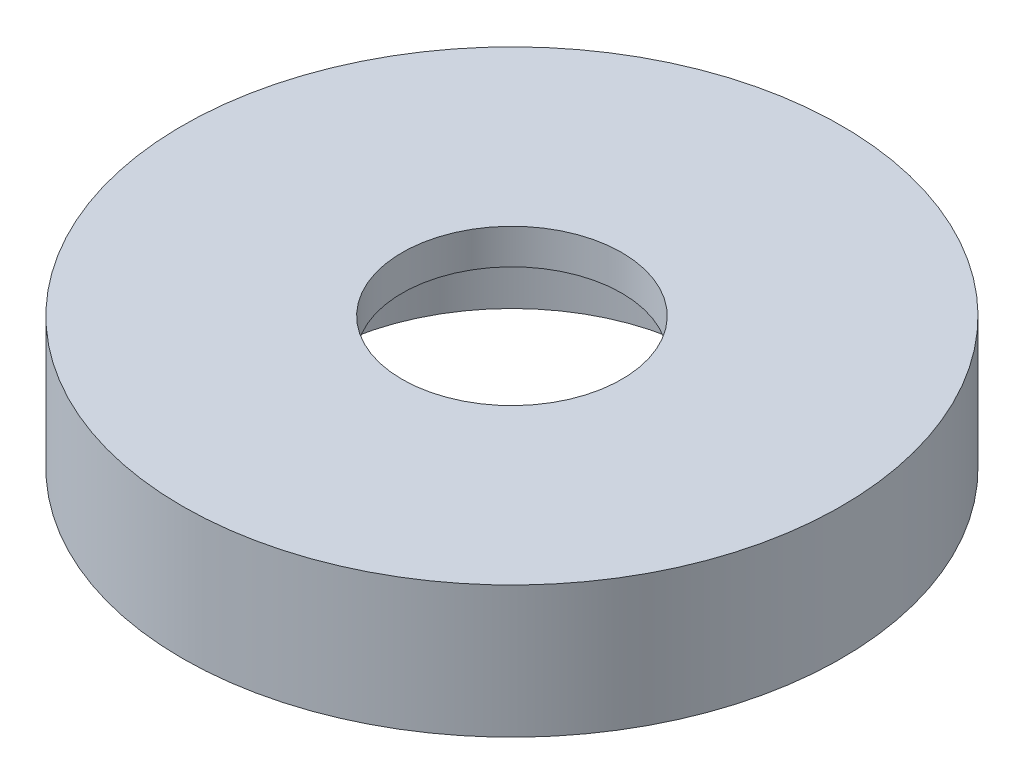
ISO-10303-21;
HEADER;
FILE_DESCRIPTION(('STEP AP214'),'2;1');
FILE_NAME('part.step','',(''),(''),'','','');
FILE_SCHEMA(('AUTOMOTIVE_DESIGN { 1 0 10303 214 1 1 1 1 }'));
ENDSEC;
DATA;
#1=APPLICATION_CONTEXT('core data for automotive mechanical design processes');
#2=APPLICATION_PROTOCOL_DEFINITION('international standard','automotive_design',2000,#1);
#3=PRODUCT_CONTEXT('',#1,'mechanical');
#4=PRODUCT('Part','Part','',(#3));
#5=PRODUCT_RELATED_PRODUCT_CATEGORY('part','',(#4));
#6=PRODUCT_DEFINITION_FORMATION('','',#4);
#7=PRODUCT_DEFINITION_CONTEXT('part definition',#1,'design');
#8=PRODUCT_DEFINITION('design','',#6,#7);
#9=PRODUCT_DEFINITION_SHAPE('','',#8);
#10=(LENGTH_UNIT() NAMED_UNIT(*) SI_UNIT(.MILLI.,.METRE.));
#11=(NAMED_UNIT(*) PLANE_ANGLE_UNIT() SI_UNIT($,.RADIAN.));
#12=(NAMED_UNIT(*) SI_UNIT($,.STERADIAN.) SOLID_ANGLE_UNIT());
#13=UNCERTAINTY_MEASURE_WITH_UNIT(LENGTH_MEASURE(1.E-05),#10,'distance_accuracy_value','');
#14=(GEOMETRIC_REPRESENTATION_CONTEXT(3) GLOBAL_UNCERTAINTY_ASSIGNED_CONTEXT((#13)) GLOBAL_UNIT_ASSIGNED_CONTEXT((#10,
#11,#12)) REPRESENTATION_CONTEXT('',''));
#15=CARTESIAN_POINT('',(0.,0.,0.));
#16=DIRECTION('',(0.,0.,1.));
#17=DIRECTION('',(1.,0.,0.));
#18=AXIS2_PLACEMENT_3D('',#15,#16,#17);
#19=CARTESIAN_POINT('',(0.,19.05,0.));
#20=DIRECTION('',(0.,-1.,0.));
#21=DIRECTION('',(0.,0.,-1.));
#22=AXIS2_PLACEMENT_3D('',#19,#20,#21);
#23=CYLINDRICAL_SURFACE('',#22,95.25);
#24=CARTESIAN_POINT('',(0.,19.05,0.));
#25=DIRECTION('',(0.,1.,0.));
#26=DIRECTION('',(0.,0.,1.));
#27=AXIS2_PLACEMENT_3D('',#24,#25,#26);
#28=CIRCLE('',#27,95.25);
#29=CARTESIAN_POINT('',(0.,19.05,95.25));
#30=VERTEX_POINT('',#29);
#31=EDGE_CURVE('E10',#30,#30,#28,.T.);
#32=ORIENTED_EDGE('',*,*,#31,.F.);
#33=EDGE_LOOP('',(#32));
#34=FACE_BOUND('',#33,.T.);
#35=CARTESIAN_POINT('',(0.,-19.05,0.));
#36=DIRECTION('',(0.,1.,0.));
#37=DIRECTION('',(0.,0.,1.));
#38=AXIS2_PLACEMENT_3D('',#35,#36,#37);
#39=CIRCLE('',#38,95.25);
#40=CARTESIAN_POINT('',(0.,-19.05,95.25));
#41=VERTEX_POINT('',#40);
#42=EDGE_CURVE('E39',#41,#41,#39,.T.);
#43=ORIENTED_EDGE('',*,*,#42,.T.);
#44=EDGE_LOOP('',(#43));
#45=FACE_BOUND('',#44,.T.);
#46=ADVANCED_FACE('F36',(#34,#45),#23,.T.);
#47=CARTESIAN_POINT('',(0.,19.05,0.));
#48=DIRECTION('',(0.,1.,0.));
#49=DIRECTION('',(0.,0.,1.));
#50=AXIS2_PLACEMENT_3D('',#47,#48,#49);
#51=PLANE('',#50);
#52=CARTESIAN_POINT('',(0.,19.05,0.));
#53=DIRECTION('',(0.,1.,0.));
#54=DIRECTION('',(0.,0.,1.));
#55=AXIS2_PLACEMENT_3D('',#52,#53,#54);
#56=CIRCLE('',#55,31.75);
#57=CARTESIAN_POINT('',(0.,19.05,31.75));
#58=VERTEX_POINT('',#57);
#59=EDGE_CURVE('E46',#58,#58,#56,.T.);
#60=ORIENTED_EDGE('',*,*,#59,.F.);
#61=EDGE_LOOP('',(#60));
#62=FACE_BOUND('',#61,.T.);
#63=ORIENTED_EDGE('',*,*,#31,.T.);
#64=EDGE_LOOP('',(#63));
#65=FACE_BOUND('',#64,.T.);
#66=ADVANCED_FACE('F84',(#62,#65),#51,.T.);
#67=CARTESIAN_POINT('',(0.,-19.05,0.));
#68=DIRECTION('',(0.,1.,0.));
#69=DIRECTION('',(0.,0.,1.));
#70=AXIS2_PLACEMENT_3D('',#67,#68,#69);
#71=PLANE('',#70);
#72=CARTESIAN_POINT('',(38.1000000000003,-19.05,65.9911357683741));
#73=DIRECTION('',(0.,-1.,0.));
#74=DIRECTION('',(-0.866025403784436,0.,0.500000000000004));
#75=AXIS2_PLACEMENT_3D('',#72,#73,#74);
#76=CIRCLE('',#75,3.175);
#77=CARTESIAN_POINT('',(35.3503693429847,-19.05,67.5786357683741));
#78=VERTEX_POINT('',#77);
#79=EDGE_CURVE('E69',#78,#78,#76,.T.);
#80=ORIENTED_EDGE('',*,*,#79,.F.);
#81=EDGE_LOOP('',(#80));
#82=FACE_BOUND('',#81,.T.);
#83=CARTESIAN_POINT('',(38.0999999999994,-19.05,-65.9911357683746));
#84=DIRECTION('',(0.,-1.,0.));
#85=DIRECTION('',(0.866025403784443,0.,0.499999999999992));
#86=AXIS2_PLACEMENT_3D('',#83,#84,#85);
#87=CIRCLE('',#86,3.175);
#88=CARTESIAN_POINT('',(40.849630657015,-19.05,-64.4036357683746));
#89=VERTEX_POINT('',#88);
#90=EDGE_CURVE('E70',#89,#89,#87,.T.);
#91=ORIENTED_EDGE('',*,*,#90,.F.);
#92=EDGE_LOOP('',(#91));
#93=FACE_BOUND('',#92,.T.);
#94=CARTESIAN_POINT('',(-76.2,-19.05,0.));
#95=DIRECTION('',(0.,-1.,0.));
#96=DIRECTION('',(0.,0.,-1.));
#97=AXIS2_PLACEMENT_3D('',#94,#95,#96);
#98=CIRCLE('',#97,3.175);
#99=CARTESIAN_POINT('',(-76.2,-19.05,-3.175));
#100=VERTEX_POINT('',#99);
#101=EDGE_CURVE('E60',#100,#100,#98,.T.);
#102=ORIENTED_EDGE('',*,*,#101,.F.);
#103=EDGE_LOOP('',(#102));
#104=FACE_BOUND('',#103,.T.);
#105=CARTESIAN_POINT('',(0.,-19.05,0.));
#106=DIRECTION('',(0.,-1.,0.));
#107=DIRECTION('',(0.,0.,-1.));
#108=AXIS2_PLACEMENT_3D('',#105,#106,#107);
#109=CIRCLE('',#108,56.515);
#110=CARTESIAN_POINT('',(0.,-19.05,-56.515));
#111=VERTEX_POINT('',#110);
#112=EDGE_CURVE('E56',#111,#111,#109,.T.);
#113=ORIENTED_EDGE('',*,*,#112,.F.);
#114=EDGE_LOOP('',(#113));
#115=FACE_BOUND('',#114,.T.);
#116=ORIENTED_EDGE('',*,*,#42,.F.);
#117=EDGE_LOOP('',(#116));
#118=FACE_BOUND('',#117,.T.);
#119=ADVANCED_FACE('F80',(#82,#93,#104,#115,#118),#71,.F.);
#120=CARTESIAN_POINT('',(0.,8.89,0.));
#121=DIRECTION('',(0.,1.,0.));
#122=DIRECTION('',(0.,0.,1.));
#123=AXIS2_PLACEMENT_3D('',#120,#121,#122);
#124=CYLINDRICAL_SURFACE('',#123,31.75);
#125=CARTESIAN_POINT('',(0.,8.89,0.));
#126=DIRECTION('',(0.,1.,0.));
#127=DIRECTION('',(0.,0.,1.));
#128=AXIS2_PLACEMENT_3D('',#125,#126,#127);
#129=CIRCLE('',#128,31.75);
#130=CARTESIAN_POINT('',(0.,8.89,31.75));
#131=VERTEX_POINT('',#130);
#132=EDGE_CURVE('E50',#131,#131,#129,.T.);
#133=ORIENTED_EDGE('',*,*,#132,.F.);
#134=EDGE_LOOP('',(#133));
#135=FACE_BOUND('',#134,.T.);
#136=ORIENTED_EDGE('',*,*,#59,.T.);
#137=EDGE_LOOP('',(#136));
#138=FACE_BOUND('',#137,.T.);
#139=ADVANCED_FACE('F83',(#135,#138),#124,.F.);
#140=CARTESIAN_POINT('',(0.,8.89,0.));
#141=DIRECTION('',(0.,1.,0.));
#142=DIRECTION('',(0.,0.,1.));
#143=AXIS2_PLACEMENT_3D('',#140,#141,#142);
#144=PLANE('',#143);
#145=ORIENTED_EDGE('',*,*,#132,.T.);
#146=EDGE_LOOP('',(#145));
#147=FACE_BOUND('',#146,.T.);
#148=CARTESIAN_POINT('',(0.,8.89000000000001,0.));
#149=DIRECTION('',(0.,1.,0.));
#150=DIRECTION('',(0.,0.,1.));
#151=AXIS2_PLACEMENT_3D('',#148,#149,#150);
#152=CIRCLE('',#151,56.515);
#153=CARTESIAN_POINT('',(0.,8.89000000000001,56.515));
#154=VERTEX_POINT('',#153);
#155=EDGE_CURVE('E53',#154,#154,#152,.F.);
#156=ORIENTED_EDGE('',*,*,#155,.T.);
#157=EDGE_LOOP('',(#156));
#158=FACE_BOUND('',#157,.T.);
#159=ADVANCED_FACE('F107',(#147,#158),#144,.F.);
#160=CARTESIAN_POINT('',(0.,168.738558955031,0.));
#161=DIRECTION('',(0.,-1.,0.));
#162=DIRECTION('',(0.,0.,-1.));
#163=AXIS2_PLACEMENT_3D('',#160,#161,#162);
#164=CYLINDRICAL_SURFACE('',#163,56.515);
#165=ORIENTED_EDGE('',*,*,#112,.T.);
#166=EDGE_LOOP('',(#165));
#167=FACE_BOUND('',#166,.T.);
#168=ORIENTED_EDGE('',*,*,#155,.F.);
#169=EDGE_LOOP('',(#168));
#170=FACE_BOUND('',#169,.T.);
#171=ADVANCED_FACE('F111',(#167,#170),#164,.F.);
#172=CARTESIAN_POINT('',(-76.2,0.,0.));
#173=DIRECTION('',(0.,-1.,0.));
#174=DIRECTION('',(0.,0.,-1.));
#175=AXIS2_PLACEMENT_3D('',#172,#173,#174);
#176=CYLINDRICAL_SURFACE('',#175,3.175);
#177=CARTESIAN_POINT('',(-76.2,0.,0.));
#178=DIRECTION('',(0.,-1.,0.));
#179=DIRECTION('',(0.,0.,-1.));
#180=AXIS2_PLACEMENT_3D('',#177,#178,#179);
#181=CIRCLE('',#180,3.175);
#182=CARTESIAN_POINT('',(-76.2,0.,-3.175));
#183=VERTEX_POINT('',#182);
#184=EDGE_CURVE('E59',#183,#183,#181,.T.);
#185=ORIENTED_EDGE('',*,*,#184,.F.);
#186=EDGE_LOOP('',(#185));
#187=FACE_BOUND('',#186,.T.);
#188=ORIENTED_EDGE('',*,*,#101,.T.);
#189=EDGE_LOOP('',(#188));
#190=FACE_BOUND('',#189,.T.);
#191=ADVANCED_FACE('F115',(#187,#190),#176,.F.);
#192=CARTESIAN_POINT('',(-76.2,0.,0.));
#193=DIRECTION('',(0.,-1.,0.));
#194=DIRECTION('',(0.,0.,-1.));
#195=AXIS2_PLACEMENT_3D('',#192,#193,#194);
#196=PLANE('',#195);
#197=ORIENTED_EDGE('',*,*,#184,.T.);
#198=EDGE_LOOP('',(#197));
#199=FACE_BOUND('',#198,.T.);
#200=ADVANCED_FACE('F119',(#199),#196,.T.);
#201=CARTESIAN_POINT('',(38.0999999999994,0.,-65.9911357683746));
#202=DIRECTION('',(0.,-1.,0.));
#203=DIRECTION('',(0.866025403784443,0.,0.499999999999992));
#204=AXIS2_PLACEMENT_3D('',#201,#202,#203);
#205=CYLINDRICAL_SURFACE('',#204,3.175);
#206=CARTESIAN_POINT('',(38.0999999999994,0.,-65.9911357683746));
#207=DIRECTION('',(0.,-1.,0.));
#208=DIRECTION('',(0.866025403784443,0.,0.499999999999992));
#209=AXIS2_PLACEMENT_3D('',#206,#207,#208);
#210=CIRCLE('',#209,3.175);
#211=CARTESIAN_POINT('',(40.849630657015,0.,-64.4036357683746));
#212=VERTEX_POINT('',#211);
#213=EDGE_CURVE('E66',#212,#212,#210,.T.);
#214=ORIENTED_EDGE('',*,*,#213,.F.);
#215=EDGE_LOOP('',(#214));
#216=FACE_BOUND('',#215,.T.);
#217=ORIENTED_EDGE('',*,*,#90,.T.);
#218=EDGE_LOOP('',(#217));
#219=FACE_BOUND('',#218,.T.);
#220=ADVANCED_FACE('F123',(#216,#219),#205,.F.);
#221=CARTESIAN_POINT('',(38.0999999999994,0.,-65.9911357683746));
#222=DIRECTION('',(0.,-1.,0.));
#223=DIRECTION('',(0.866025403784443,0.,0.499999999999992));
#224=AXIS2_PLACEMENT_3D('',#221,#222,#223);
#225=PLANE('',#224);
#226=ORIENTED_EDGE('',*,*,#213,.T.);
#227=EDGE_LOOP('',(#226));
#228=FACE_BOUND('',#227,.T.);
#229=ADVANCED_FACE('F127',(#228),#225,.T.);
#230=CARTESIAN_POINT('',(38.1000000000003,0.,65.9911357683741));
#231=DIRECTION('',(0.,-1.,0.));
#232=DIRECTION('',(-0.866025403784436,0.,0.500000000000004));
#233=AXIS2_PLACEMENT_3D('',#230,#231,#232);
#234=CYLINDRICAL_SURFACE('',#233,3.175);
#235=CARTESIAN_POINT('',(38.1000000000003,0.,65.9911357683741));
#236=DIRECTION('',(0.,-1.,0.));
#237=DIRECTION('',(-0.866025403784436,0.,0.500000000000004));
#238=AXIS2_PLACEMENT_3D('',#235,#236,#237);
#239=CIRCLE('',#238,3.175);
#240=CARTESIAN_POINT('',(35.3503693429847,0.,67.5786357683741));
#241=VERTEX_POINT('',#240);
#242=EDGE_CURVE('E63',#241,#241,#239,.T.);
#243=ORIENTED_EDGE('',*,*,#242,.F.);
#244=EDGE_LOOP('',(#243));
#245=FACE_BOUND('',#244,.T.);
#246=ORIENTED_EDGE('',*,*,#79,.T.);
#247=EDGE_LOOP('',(#246));
#248=FACE_BOUND('',#247,.T.);
#249=ADVANCED_FACE('F78',(#245,#248),#234,.F.);
#250=CARTESIAN_POINT('',(38.1000000000003,0.,65.9911357683741));
#251=DIRECTION('',(0.,-1.,0.));
#252=DIRECTION('',(-0.866025403784436,0.,0.500000000000004));
#253=AXIS2_PLACEMENT_3D('',#250,#251,#252);
#254=PLANE('',#253);
#255=ORIENTED_EDGE('',*,*,#242,.T.);
#256=EDGE_LOOP('',(#255));
#257=FACE_BOUND('',#256,.T.);
#258=ADVANCED_FACE('F134',(#257),#254,.T.);
#259=CLOSED_SHELL('',(#46,#66,#119,#139,#159,#171,#191,#200,#220,#229,#249,#258));
#260=MANIFOLD_SOLID_BREP('B2',#259);
#261=ADVANCED_BREP_SHAPE_REPRESENTATION('',(#18,#260),#14);
#262=SHAPE_DEFINITION_REPRESENTATION(#9,#261);
ENDSEC;
END-ISO-10303-21;
